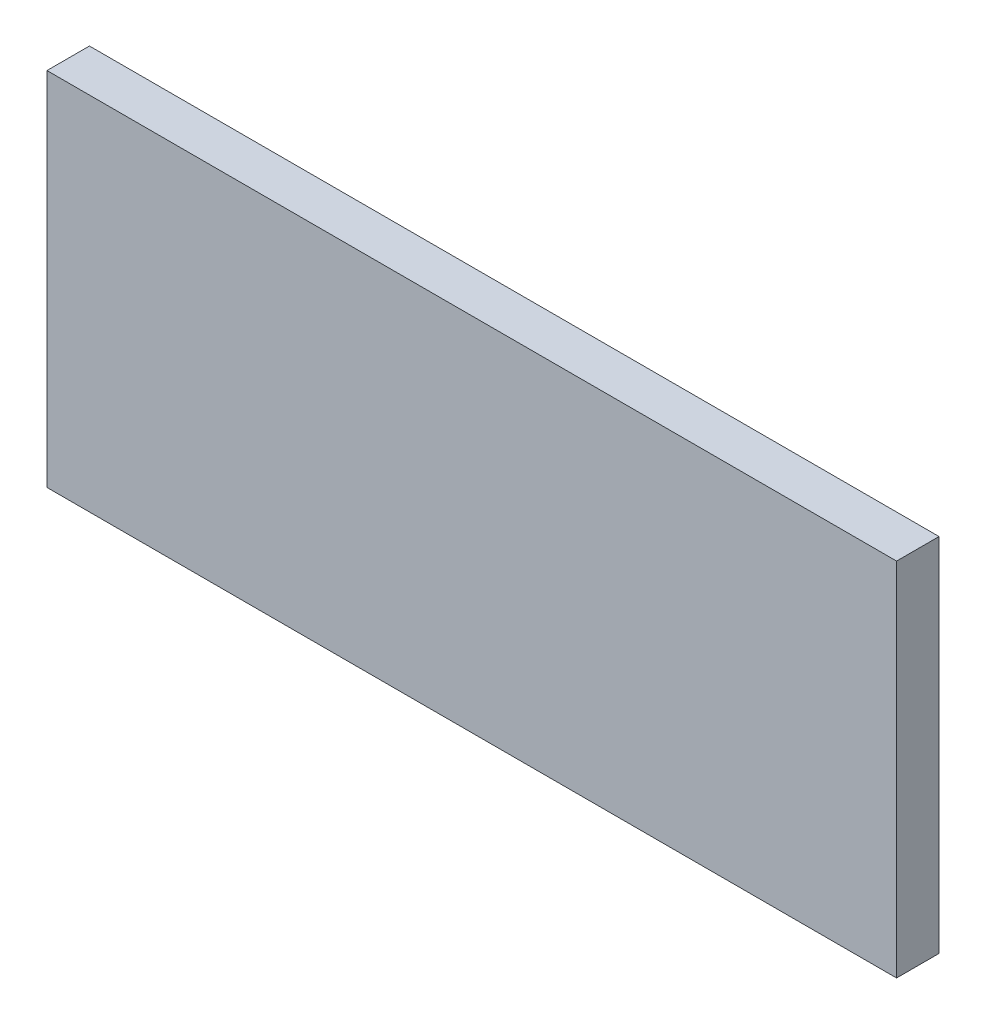
ISO-10303-21;
HEADER;
FILE_DESCRIPTION(('STEP AP214'),'2;1');
FILE_NAME('part.step','',(''),(''),'','','');
FILE_SCHEMA(('AUTOMOTIVE_DESIGN { 1 0 10303 214 1 1 1 1 }'));
ENDSEC;
DATA;
#1=APPLICATION_CONTEXT('core data for automotive mechanical design processes');
#2=APPLICATION_PROTOCOL_DEFINITION('international standard','automotive_design',2000,#1);
#3=PRODUCT_CONTEXT('',#1,'mechanical');
#4=PRODUCT('Part','Part','',(#3));
#5=PRODUCT_RELATED_PRODUCT_CATEGORY('part','',(#4));
#6=PRODUCT_DEFINITION_FORMATION('','',#4);
#7=PRODUCT_DEFINITION_CONTEXT('part definition',#1,'design');
#8=PRODUCT_DEFINITION('design','',#6,#7);
#9=PRODUCT_DEFINITION_SHAPE('','',#8);
#10=(LENGTH_UNIT() NAMED_UNIT(*) SI_UNIT(.MILLI.,.METRE.));
#11=(NAMED_UNIT(*) PLANE_ANGLE_UNIT() SI_UNIT($,.RADIAN.));
#12=(NAMED_UNIT(*) SI_UNIT($,.STERADIAN.) SOLID_ANGLE_UNIT());
#13=UNCERTAINTY_MEASURE_WITH_UNIT(LENGTH_MEASURE(1.E-05),#10,'distance_accuracy_value','');
#14=(GEOMETRIC_REPRESENTATION_CONTEXT(3) GLOBAL_UNCERTAINTY_ASSIGNED_CONTEXT((#13)) GLOBAL_UNIT_ASSIGNED_CONTEXT((#10,
#11,#12)) REPRESENTATION_CONTEXT('',''));
#15=CARTESIAN_POINT('',(0.,0.,0.));
#16=DIRECTION('',(0.,0.,1.));
#17=DIRECTION('',(1.,0.,0.));
#18=AXIS2_PLACEMENT_3D('',#15,#16,#17);
#19=CARTESIAN_POINT('',(0.,0.,100.));
#20=DIRECTION('',(-1.,0.,0.));
#21=DIRECTION('',(0.,-1.,0.));
#22=AXIS2_PLACEMENT_3D('',#19,#20,#21);
#23=PLANE('',#22);
#24=DIRECTION('',(0.,1.,0.));
#25=VECTOR('',#24,1.);
#26=CARTESIAN_POINT('',(0.,0.,0.));
#27=LINE('',#26,#25);
#28=CARTESIAN_POINT('',(1.04094977927525E-13,-850.,0.));
#29=VERTEX_POINT('',#28);
#30=CARTESIAN_POINT('',(0.,0.,0.));
#31=VERTEX_POINT('',#30);
#32=EDGE_CURVE('E95',#29,#31,#27,.T.);
#33=ORIENTED_EDGE('',*,*,#32,.T.);
#34=DIRECTION('',(0.,0.,-1.));
#35=VECTOR('',#34,1.);
#36=CARTESIAN_POINT('',(0.,0.,100.));
#37=LINE('',#36,#35);
#38=CARTESIAN_POINT('',(0.,0.,100.));
#39=VERTEX_POINT('',#38);
#40=EDGE_CURVE('E11',#39,#31,#37,.T.);
#41=ORIENTED_EDGE('',*,*,#40,.F.);
#42=DIRECTION('',(0.,1.,0.));
#43=VECTOR('',#42,1.);
#44=CARTESIAN_POINT('',(0.,0.,100.));
#45=LINE('',#44,#43);
#46=CARTESIAN_POINT('',(1.04094977927525E-13,-850.,100.));
#47=VERTEX_POINT('',#46);
#48=EDGE_CURVE('E83',#47,#39,#45,.T.);
#49=ORIENTED_EDGE('',*,*,#48,.F.);
#50=DIRECTION('',(0.,0.,-1.));
#51=VECTOR('',#50,1.);
#52=CARTESIAN_POINT('',(1.04094977927525E-13,-850.,100.));
#53=LINE('',#52,#51);
#54=EDGE_CURVE('E91',#47,#29,#53,.T.);
#55=ORIENTED_EDGE('',*,*,#54,.T.);
#56=EDGE_LOOP('',(#33,#41,#49,#55));
#57=FACE_BOUND('',#56,.T.);
#58=ADVANCED_FACE('F32',(#57),#23,.F.);
#59=CARTESIAN_POINT('',(0.,0.,100.));
#60=DIRECTION('',(0.,-1.,0.));
#61=DIRECTION('',(1.,0.,0.));
#62=AXIS2_PLACEMENT_3D('',#59,#60,#61);
#63=PLANE('',#62);
#64=DIRECTION('',(-1.,0.,0.));
#65=VECTOR('',#64,1.);
#66=CARTESIAN_POINT('',(0.,0.,0.));
#67=LINE('',#66,#65);
#68=CARTESIAN_POINT('',(-2000.,-2.44929359829471E-13,0.));
#69=VERTEX_POINT('',#68);
#70=EDGE_CURVE('E87',#31,#69,#67,.T.);
#71=ORIENTED_EDGE('',*,*,#70,.T.);
#72=DIRECTION('',(0.,0.,-1.));
#73=VECTOR('',#72,1.);
#74=CARTESIAN_POINT('',(-2000.,-2.44929359829471E-13,100.));
#75=LINE('',#74,#73);
#76=CARTESIAN_POINT('',(-2000.,-2.44929359829471E-13,100.));
#77=VERTEX_POINT('',#76);
#78=EDGE_CURVE('E40',#77,#69,#75,.T.);
#79=ORIENTED_EDGE('',*,*,#78,.F.);
#80=DIRECTION('',(-1.,0.,0.));
#81=VECTOR('',#80,1.);
#82=CARTESIAN_POINT('',(0.,0.,100.));
#83=LINE('',#82,#81);
#84=EDGE_CURVE('E78',#39,#77,#83,.T.);
#85=ORIENTED_EDGE('',*,*,#84,.F.);
#86=ORIENTED_EDGE('',*,*,#40,.T.);
#87=EDGE_LOOP('',(#71,#79,#85,#86));
#88=FACE_BOUND('',#87,.T.);
#89=ADVANCED_FACE('F86',(#88),#63,.F.);
#90=CARTESIAN_POINT('',(-2000.,-2.44929359829471E-13,100.));
#91=DIRECTION('',(1.,0.,0.));
#92=DIRECTION('',(0.,0.,-1.));
#93=AXIS2_PLACEMENT_3D('',#90,#91,#92);
#94=PLANE('',#93);
#95=DIRECTION('',(0.,-1.,0.));
#96=VECTOR('',#95,1.);
#97=CARTESIAN_POINT('',(-2000.,-2.44929359829471E-13,0.));
#98=LINE('',#97,#96);
#99=CARTESIAN_POINT('',(-2000.,-850.,0.));
#100=VERTEX_POINT('',#99);
#101=EDGE_CURVE('E65',#69,#100,#98,.T.);
#102=ORIENTED_EDGE('',*,*,#101,.T.);
#103=DIRECTION('',(0.,0.,-1.));
#104=VECTOR('',#103,1.);
#105=CARTESIAN_POINT('',(-2000.,-850.,100.));
#106=LINE('',#105,#104);
#107=CARTESIAN_POINT('',(-2000.,-850.,100.));
#108=VERTEX_POINT('',#107);
#109=EDGE_CURVE('E88',#108,#100,#106,.T.);
#110=ORIENTED_EDGE('',*,*,#109,.F.);
#111=DIRECTION('',(0.,-1.,0.));
#112=VECTOR('',#111,1.);
#113=CARTESIAN_POINT('',(-2000.,-2.44929359829471E-13,100.));
#114=LINE('',#113,#112);
#115=EDGE_CURVE('E81',#77,#108,#114,.T.);
#116=ORIENTED_EDGE('',*,*,#115,.F.);
#117=ORIENTED_EDGE('',*,*,#78,.T.);
#118=EDGE_LOOP('',(#102,#110,#116,#117));
#119=FACE_BOUND('',#118,.T.);
#120=ADVANCED_FACE('F89',(#119),#94,.F.);
#121=CARTESIAN_POINT('',(1.04094977927525E-13,-850.,100.));
#122=DIRECTION('',(0.,1.,0.));
#123=DIRECTION('',(-1.,0.,0.));
#124=AXIS2_PLACEMENT_3D('',#121,#122,#123);
#125=PLANE('',#124);
#126=DIRECTION('',(1.,0.,0.));
#127=VECTOR('',#126,1.);
#128=CARTESIAN_POINT('',(1.04094977927525E-13,-850.,0.));
#129=LINE('',#128,#127);
#130=EDGE_CURVE('E71',#100,#29,#129,.T.);
#131=ORIENTED_EDGE('',*,*,#130,.T.);
#132=ORIENTED_EDGE('',*,*,#54,.F.);
#133=DIRECTION('',(1.,0.,0.));
#134=VECTOR('',#133,1.);
#135=CARTESIAN_POINT('',(1.04094977927525E-13,-850.,100.));
#136=LINE('',#135,#134);
#137=EDGE_CURVE('E48',#108,#47,#136,.T.);
#138=ORIENTED_EDGE('',*,*,#137,.F.);
#139=ORIENTED_EDGE('',*,*,#109,.T.);
#140=EDGE_LOOP('',(#131,#132,#138,#139));
#141=FACE_BOUND('',#140,.T.);
#142=ADVANCED_FACE('F102',(#141),#125,.F.);
#143=CARTESIAN_POINT('',(0.,0.,100.));
#144=DIRECTION('',(0.,0.,-1.));
#145=DIRECTION('',(-1.,0.,0.));
#146=AXIS2_PLACEMENT_3D('',#143,#144,#145);
#147=PLANE('',#146);
#148=ORIENTED_EDGE('',*,*,#48,.T.);
#149=ORIENTED_EDGE('',*,*,#84,.T.);
#150=ORIENTED_EDGE('',*,*,#115,.T.);
#151=ORIENTED_EDGE('',*,*,#137,.T.);
#152=EDGE_LOOP('',(#148,#149,#150,#151));
#153=FACE_BOUND('',#152,.T.);
#154=ADVANCED_FACE('F79',(#153),#147,.F.);
#155=CARTESIAN_POINT('',(0.,0.,0.));
#156=DIRECTION('',(0.,0.,-1.));
#157=DIRECTION('',(-1.,0.,0.));
#158=AXIS2_PLACEMENT_3D('',#155,#156,#157);
#159=PLANE('',#158);
#160=ORIENTED_EDGE('',*,*,#32,.F.);
#161=ORIENTED_EDGE('',*,*,#130,.F.);
#162=ORIENTED_EDGE('',*,*,#101,.F.);
#163=ORIENTED_EDGE('',*,*,#70,.F.);
#164=EDGE_LOOP('',(#160,#161,#162,#163));
#165=FACE_BOUND('',#164,.T.);
#166=ADVANCED_FACE('F105',(#165),#159,.T.);
#167=CLOSED_SHELL('',(#58,#89,#120,#142,#154,#166));
#168=MANIFOLD_SOLID_BREP('B2',#167);
#169=ADVANCED_BREP_SHAPE_REPRESENTATION('',(#18,#168),#14);
#170=SHAPE_DEFINITION_REPRESENTATION(#9,#169);
ENDSEC;
END-ISO-10303-21;
